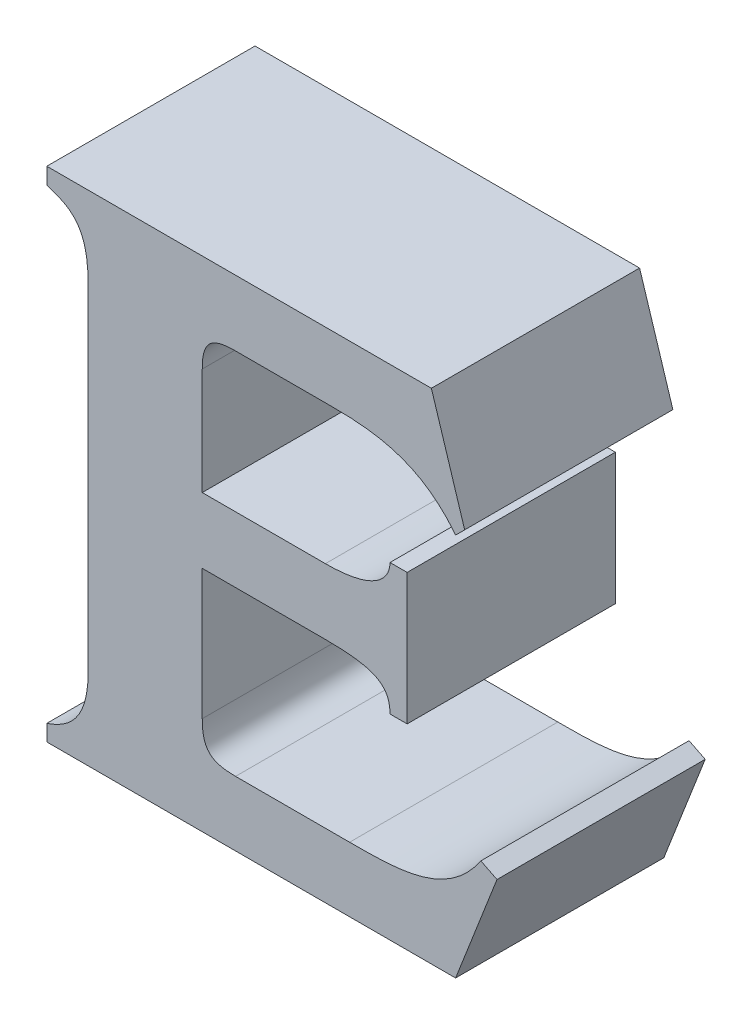
ISO-10303-21;
HEADER;
FILE_DESCRIPTION(('STEP AP214'),'2;1');
FILE_NAME('part.step','',(''),(''),'','','');
FILE_SCHEMA(('AUTOMOTIVE_DESIGN { 1 0 10303 214 1 1 1 1 }'));
ENDSEC;
DATA;
#1=APPLICATION_CONTEXT('core data for automotive mechanical design processes');
#2=APPLICATION_PROTOCOL_DEFINITION('international standard','automotive_design',2000,#1);
#3=PRODUCT_CONTEXT('',#1,'mechanical');
#4=PRODUCT('Part','Part','',(#3));
#5=PRODUCT_RELATED_PRODUCT_CATEGORY('part','',(#4));
#6=PRODUCT_DEFINITION_FORMATION('','',#4);
#7=PRODUCT_DEFINITION_CONTEXT('part definition',#1,'design');
#8=PRODUCT_DEFINITION('design','',#6,#7);
#9=PRODUCT_DEFINITION_SHAPE('','',#8);
#10=(LENGTH_UNIT() NAMED_UNIT(*) SI_UNIT(.MILLI.,.METRE.));
#11=(NAMED_UNIT(*) PLANE_ANGLE_UNIT() SI_UNIT($,.RADIAN.));
#12=(NAMED_UNIT(*) SI_UNIT($,.STERADIAN.) SOLID_ANGLE_UNIT());
#13=UNCERTAINTY_MEASURE_WITH_UNIT(LENGTH_MEASURE(1.E-05),#10,'distance_accuracy_value','');
#14=(GEOMETRIC_REPRESENTATION_CONTEXT(3) GLOBAL_UNCERTAINTY_ASSIGNED_CONTEXT((#13)) GLOBAL_UNIT_ASSIGNED_CONTEXT((#10,
#11,#12)) REPRESENTATION_CONTEXT('',''));
#15=CARTESIAN_POINT('',(0.,0.,0.));
#16=DIRECTION('',(0.,0.,1.));
#17=DIRECTION('',(1.,0.,0.));
#18=AXIS2_PLACEMENT_3D('',#15,#16,#17);
#19=CARTESIAN_POINT('',(3.83157900996,-0.200329401425036,0.));
#20=CARTESIAN_POINT('',(3.83157900996,-0.200329401425036,0.1));
#21=CARTESIAN_POINT('',(3.8432141238243,-0.20420750912214,0.));
#22=CARTESIAN_POINT('',(3.8432141238243,-0.20420750912214,0.1));
#23=CARTESIAN_POINT('',(3.8514555885926,-0.2080857603454,0.));
#24=CARTESIAN_POINT('',(3.8514555885926,-0.2080857603454,0.1));
#25=CARTESIAN_POINT('',(3.8514555894469,-0.231839582517053,0.));
#26=CARTESIAN_POINT('',(3.8514555894469,-0.231839582517053,0.1));
#27=B_SPLINE_SURFACE_WITH_KNOTS('',3,1,((#19,#20),(#21,#22),(#23,#24),(#25,#26)),.UNSPECIFIED.,
.F.,.F.,.F.,(4,4),(2,2),(-1.,0.),(0.,0.01),.UNSPECIFIED.);
#28=CARTESIAN_POINT('',(3.8514555894469,-0.231839582517053,0.));
#29=CARTESIAN_POINT('',(3.8514555885926,-0.2080857603454,0.));
#30=CARTESIAN_POINT('',(3.8432141238243,-0.20420750912214,0.));
#31=CARTESIAN_POINT('',(3.83157900996,-0.200329401425036,0.));
#32=B_SPLINE_CURVE_WITH_KNOTS('',3,(#28,#29,#30,#31),.UNSPECIFIED.,.F.,.F.,(4,4),(0.,1.),.UNSPECIFIED.);
#33=CARTESIAN_POINT('',(3.8514555894469,-0.231839582517053,0.));
#34=VERTEX_POINT('',#33);
#35=CARTESIAN_POINT('',(3.83157900996,-0.200329401425036,0.));
#36=VERTEX_POINT('',#35);
#37=EDGE_CURVE('E11',#34,#36,#32,.T.);
#38=DIRECTION('',(0.,0.,1.));
#39=VECTOR('',#38,1.);
#40=CARTESIAN_POINT('',(3.8514555894469,-0.231839582517053,0.));
#41=LINE('',#40,#39);
#42=CARTESIAN_POINT('',(3.8514555894469,-0.231839582517053,0.1));
#43=VERTEX_POINT('',#42);
#44=EDGE_CURVE('E28',#34,#43,#41,.T.);
#45=CARTESIAN_POINT('',(3.83157900996,-0.200329401425036,0.1));
#46=CARTESIAN_POINT('',(3.8432141238243,-0.20420750912214,0.1));
#47=CARTESIAN_POINT('',(3.8514555885926,-0.2080857603454,0.1));
#48=CARTESIAN_POINT('',(3.8514555894469,-0.231839582517053,0.1));
#49=B_SPLINE_CURVE_WITH_KNOTS('',3,(#45,#46,#47,#48),.UNSPECIFIED.,.F.,.F.,(4,4),(-1.,0.),.UNSPECIFIED.);
#50=CARTESIAN_POINT('',(3.83157900996,-0.200329401425036,0.1));
#51=VERTEX_POINT('',#50);
#52=EDGE_CURVE('E212',#51,#43,#49,.T.);
#53=DIRECTION('',(0.,0.,1.));
#54=VECTOR('',#53,1.);
#55=CARTESIAN_POINT('',(3.83157900996,-0.200329401425036,0.));
#56=LINE('',#55,#54);
#57=EDGE_CURVE('E467',#36,#51,#56,.T.);
#58=ORIENTED_EDGE('',*,*,#37,.F.);
#59=ORIENTED_EDGE('',*,*,#44,.T.);
#60=ORIENTED_EDGE('',*,*,#52,.F.);
#61=ORIENTED_EDGE('',*,*,#57,.F.);
#62=EDGE_LOOP('',(#58,#59,#60,#61));
#63=FACE_BOUND('',#62,.T.);
#64=ADVANCED_FACE('F17',(#63),#27,.T.);
#65=CARTESIAN_POINT('',(3.83157900996,-0.19257300647474,0.));
#66=DIRECTION('',(-1.,0.,0.));
#67=DIRECTION('',(0.,-1.,0.));
#68=AXIS2_PLACEMENT_3D('',#65,#66,#67);
#69=PLANE('',#68);
#70=DIRECTION('',(0.,1.,0.));
#71=VECTOR('',#70,1.);
#72=CARTESIAN_POINT('',(3.83157900996,-0.200329401425036,0.));
#73=LINE('',#72,#71);
#74=CARTESIAN_POINT('',(3.83157900996,-0.19257300647474,0.));
#75=VERTEX_POINT('',#74);
#76=EDGE_CURVE('E465',#36,#75,#73,.T.);
#77=ORIENTED_EDGE('',*,*,#76,.F.);
#78=ORIENTED_EDGE('',*,*,#57,.T.);
#79=DIRECTION('',(0.,-1.,0.));
#80=VECTOR('',#79,1.);
#81=CARTESIAN_POINT('',(3.83157900996,-0.200329401425036,0.1));
#82=LINE('',#81,#80);
#83=CARTESIAN_POINT('',(3.83157900996,-0.19257300647474,0.1));
#84=VERTEX_POINT('',#83);
#85=EDGE_CURVE('E463',#84,#51,#82,.T.);
#86=ORIENTED_EDGE('',*,*,#85,.F.);
#87=DIRECTION('',(0.,0.,1.));
#88=VECTOR('',#87,1.);
#89=CARTESIAN_POINT('',(3.83157900996,-0.19257300647474,0.));
#90=LINE('',#89,#88);
#91=EDGE_CURVE('E460',#75,#84,#90,.T.);
#92=ORIENTED_EDGE('',*,*,#91,.F.);
#93=EDGE_LOOP('',(#77,#78,#86,#92));
#94=FACE_BOUND('',#93,.T.);
#95=ADVANCED_FACE('F566',(#94),#69,.T.);
#96=CARTESIAN_POINT('',(4.0162776760592,-0.19257300647474,0.));
#97=DIRECTION('',(0.,1.,0.));
#98=DIRECTION('',(-1.,0.,0.));
#99=AXIS2_PLACEMENT_3D('',#96,#97,#98);
#100=PLANE('',#99);
#101=DIRECTION('',(1.,0.,0.));
#102=VECTOR('',#101,1.);
#103=CARTESIAN_POINT('',(3.83157900996,-0.19257300647474,0.));
#104=LINE('',#103,#102);
#105=CARTESIAN_POINT('',(4.0162776760592,-0.19257300647474,0.));
#106=VERTEX_POINT('',#105);
#107=EDGE_CURVE('E458',#75,#106,#104,.T.);
#108=ORIENTED_EDGE('',*,*,#107,.F.);
#109=ORIENTED_EDGE('',*,*,#91,.T.);
#110=DIRECTION('',(-1.,0.,0.));
#111=VECTOR('',#110,1.);
#112=CARTESIAN_POINT('',(3.83157900996,-0.19257300647474,0.1));
#113=LINE('',#112,#111);
#114=CARTESIAN_POINT('',(4.0162776760592,-0.19257300647474,0.1));
#115=VERTEX_POINT('',#114);
#116=EDGE_CURVE('E455',#115,#84,#113,.T.);
#117=ORIENTED_EDGE('',*,*,#116,.F.);
#118=DIRECTION('',(0.,0.,1.));
#119=VECTOR('',#118,1.);
#120=CARTESIAN_POINT('',(4.0162776760592,-0.19257300647474,0.));
#121=LINE('',#120,#119);
#122=EDGE_CURVE('E452',#106,#115,#121,.T.);
#123=ORIENTED_EDGE('',*,*,#122,.F.);
#124=EDGE_LOOP('',(#108,#109,#117,#123));
#125=FACE_BOUND('',#124,.T.);
#126=ADVANCED_FACE('F562',(#125),#100,.T.);
#127=CARTESIAN_POINT('',(4.0322752834296,-0.243474084867917,0.));
#128=DIRECTION('',(0.953993043631205,0.299828738954874,0.));
#129=DIRECTION('',(-0.299828738954874,0.953993043631205,0.));
#130=AXIS2_PLACEMENT_3D('',#127,#128,#129);
#131=PLANE('',#130);
#132=DIRECTION('',(0.299828738954873,-0.953993043631205,0.));
#133=VECTOR('',#132,1.);
#134=CARTESIAN_POINT('',(4.0162776760592,-0.19257300647474,0.));
#135=LINE('',#134,#133);
#136=CARTESIAN_POINT('',(4.0322752834296,-0.243474084867917,0.));
#137=VERTEX_POINT('',#136);
#138=EDGE_CURVE('E450',#106,#137,#135,.T.);
#139=ORIENTED_EDGE('',*,*,#138,.F.);
#140=ORIENTED_EDGE('',*,*,#122,.T.);
#141=DIRECTION('',(-0.299828738954873,0.953993043631205,0.));
#142=VECTOR('',#141,1.);
#143=CARTESIAN_POINT('',(4.0162776760592,-0.19257300647474,0.1));
#144=LINE('',#143,#142);
#145=CARTESIAN_POINT('',(4.0322752834296,-0.243474084867917,0.1));
#146=VERTEX_POINT('',#145);
#147=EDGE_CURVE('E447',#146,#115,#144,.T.);
#148=ORIENTED_EDGE('',*,*,#147,.F.);
#149=DIRECTION('',(0.,0.,1.));
#150=VECTOR('',#149,1.);
#151=CARTESIAN_POINT('',(4.0322752834296,-0.243474084867917,0.));
#152=LINE('',#151,#150);
#153=EDGE_CURVE('E444',#137,#146,#152,.T.);
#154=ORIENTED_EDGE('',*,*,#153,.F.);
#155=EDGE_LOOP('',(#139,#140,#148,#154));
#156=FACE_BOUND('',#155,.T.);
#157=ADVANCED_FACE('F558',(#156),#131,.T.);
#158=CARTESIAN_POINT('',(4.0279127909175,-0.247837117827599,0.));
#159=DIRECTION('',(0.707150577097305,-0.707062982563045,0.));
#160=DIRECTION('',(0.707062982563045,0.707150577097305,0.));
#161=AXIS2_PLACEMENT_3D('',#158,#159,#160);
#162=PLANE('',#161);
#163=DIRECTION('',(-0.707062982563045,-0.707150577097305,0.));
#164=VECTOR('',#163,1.);
#165=CARTESIAN_POINT('',(4.0322752834296,-0.243474084867917,0.));
#166=LINE('',#165,#164);
#167=CARTESIAN_POINT('',(4.0279127909175,-0.247837117827599,0.));
#168=VERTEX_POINT('',#167);
#169=EDGE_CURVE('E442',#137,#168,#166,.T.);
#170=ORIENTED_EDGE('',*,*,#169,.F.);
#171=ORIENTED_EDGE('',*,*,#153,.T.);
#172=DIRECTION('',(0.707062982563045,0.707150577097305,0.));
#173=VECTOR('',#172,1.);
#174=CARTESIAN_POINT('',(4.0322752834296,-0.243474084867917,0.1));
#175=LINE('',#174,#173);
#176=CARTESIAN_POINT('',(4.0279127909175,-0.247837117827599,0.1));
#177=VERTEX_POINT('',#176);
#178=EDGE_CURVE('E439',#177,#146,#175,.T.);
#179=ORIENTED_EDGE('',*,*,#178,.F.);
#180=DIRECTION('',(0.,0.,1.));
#181=VECTOR('',#180,1.);
#182=CARTESIAN_POINT('',(4.0279127909175,-0.247837117827599,0.));
#183=LINE('',#182,#181);
#184=EDGE_CURVE('E433',#168,#177,#183,.T.);
#185=ORIENTED_EDGE('',*,*,#184,.F.);
#186=EDGE_LOOP('',(#170,#171,#179,#185));
#187=FACE_BOUND('',#186,.T.);
#188=ADVANCED_FACE('F554',(#187),#162,.T.);
#189=CARTESIAN_POINT('',(3.9692551374246,-0.224083187566746,0.));
#190=CARTESIAN_POINT('',(3.9692551374246,-0.224083187566746,0.1));
#191=CARTESIAN_POINT('',(3.9925235660036,-0.224083187039413,0.));
#192=CARTESIAN_POINT('',(3.9925235660036,-0.224083187039413,0.1));
#193=CARTESIAN_POINT('',(4.0124001454327,-0.227961438855419,0.));
#194=CARTESIAN_POINT('',(4.0124001454327,-0.227961438855419,0.1));
#195=CARTESIAN_POINT('',(4.0279127909175,-0.247837117827599,0.));
#196=CARTESIAN_POINT('',(4.0279127909175,-0.247837117827599,0.1));
#197=B_SPLINE_SURFACE_WITH_KNOTS('',3,1,((#189,#190),(#191,#192),(#193,#194),(#195,#196)),
.UNSPECIFIED.,.F.,.F.,.F.,(4,4),(2,2),(-1.,0.),(0.,0.01),.UNSPECIFIED.);
#198=CARTESIAN_POINT('',(4.0279127909175,-0.247837117827599,0.));
#199=CARTESIAN_POINT('',(4.0124001454327,-0.227961438855419,0.));
#200=CARTESIAN_POINT('',(3.9925235660036,-0.224083187039413,0.));
#201=CARTESIAN_POINT('',(3.9692551374246,-0.224083187566746,0.));
#202=B_SPLINE_CURVE_WITH_KNOTS('',3,(#198,#199,#200,#201),.UNSPECIFIED.,.F.,.F.,(4,4),(0.,1.),.UNSPECIFIED.);
#203=CARTESIAN_POINT('',(3.9692551374246,-0.224083187566746,0.));
#204=VERTEX_POINT('',#203);
#205=EDGE_CURVE('E426',#168,#204,#202,.T.);
#206=CARTESIAN_POINT('',(3.9692551374246,-0.224083187566746,0.1));
#207=CARTESIAN_POINT('',(3.9925235660036,-0.224083187039413,0.1));
#208=CARTESIAN_POINT('',(4.0124001454327,-0.227961438855419,0.1));
#209=CARTESIAN_POINT('',(4.0279127909175,-0.247837117827599,0.1));
#210=B_SPLINE_CURVE_WITH_KNOTS('',3,(#206,#207,#208,#209),.UNSPECIFIED.,.F.,.F.,(4,4),(-1.,0.),.UNSPECIFIED.);
#211=CARTESIAN_POINT('',(3.9692551374246,-0.224083187566746,0.1));
#212=VERTEX_POINT('',#211);
#213=EDGE_CURVE('E421',#212,#177,#210,.T.);
#214=DIRECTION('',(0.,0.,1.));
#215=VECTOR('',#214,1.);
#216=CARTESIAN_POINT('',(3.9692551374246,-0.224083187566746,0.));
#217=LINE('',#216,#215);
#218=EDGE_CURVE('E418',#204,#212,#217,.T.);
#219=ORIENTED_EDGE('',*,*,#205,.F.);
#220=ORIENTED_EDGE('',*,*,#184,.T.);
#221=ORIENTED_EDGE('',*,*,#213,.F.);
#222=ORIENTED_EDGE('',*,*,#218,.F.);
#223=EDGE_LOOP('',(#219,#220,#221,#222));
#224=FACE_BOUND('',#223,.T.);
#225=ADVANCED_FACE('F550',(#224),#197,.T.);
#226=CARTESIAN_POINT('',(3.9222322384924,-0.224083187566746,0.));
#227=DIRECTION('',(0.,-1.,0.));
#228=DIRECTION('',(1.,0.,0.));
#229=AXIS2_PLACEMENT_3D('',#226,#227,#228);
#230=PLANE('',#229);
#231=DIRECTION('',(-1.,0.,0.));
#232=VECTOR('',#231,1.);
#233=CARTESIAN_POINT('',(3.9692551374246,-0.224083187566746,0.));
#234=LINE('',#233,#232);
#235=CARTESIAN_POINT('',(3.9222322384924,-0.224083187566746,0.));
#236=VERTEX_POINT('',#235);
#237=EDGE_CURVE('E416',#204,#236,#234,.T.);
#238=ORIENTED_EDGE('',*,*,#237,.F.);
#239=ORIENTED_EDGE('',*,*,#218,.T.);
#240=DIRECTION('',(1.,0.,0.));
#241=VECTOR('',#240,1.);
#242=CARTESIAN_POINT('',(3.9692551374246,-0.224083187566746,0.1));
#243=LINE('',#242,#241);
#244=CARTESIAN_POINT('',(3.9222322384924,-0.224083187566746,0.1));
#245=VERTEX_POINT('',#244);
#246=EDGE_CURVE('E413',#245,#212,#243,.T.);
#247=ORIENTED_EDGE('',*,*,#246,.F.);
#248=DIRECTION('',(0.,0.,1.));
#249=VECTOR('',#248,1.);
#250=CARTESIAN_POINT('',(3.9222322384924,-0.224083187566746,0.));
#251=LINE('',#250,#249);
#252=EDGE_CURVE('E407',#236,#245,#251,.T.);
#253=ORIENTED_EDGE('',*,*,#252,.F.);
#254=EDGE_LOOP('',(#238,#239,#247,#253));
#255=FACE_BOUND('',#254,.T.);
#256=ADVANCED_FACE('F546',(#255),#230,.T.);
#257=CARTESIAN_POINT('',(3.906234631122,-0.23959597746735,0.));
#258=CARTESIAN_POINT('',(3.906234631122,-0.23959597746735,0.1));
#259=CARTESIAN_POINT('',(3.9062346311798,-0.227961439325073,0.));
#260=CARTESIAN_POINT('',(3.9062346311798,-0.227961439325073,0.1));
#261=CARTESIAN_POINT('',(3.9101136032387,-0.224083187747447,0.));
#262=CARTESIAN_POINT('',(3.9101136032387,-0.224083187747447,0.1));
#263=CARTESIAN_POINT('',(3.9222322384924,-0.224083187566746,0.));
#264=CARTESIAN_POINT('',(3.9222322384924,-0.224083187566746,0.1));
#265=B_SPLINE_SURFACE_WITH_KNOTS('',3,1,((#257,#258),(#259,#260),(#261,#262),(#263,#264)),
.UNSPECIFIED.,.F.,.F.,.F.,(4,4),(2,2),(-1.,0.),(0.,0.01),.UNSPECIFIED.);
#266=CARTESIAN_POINT('',(3.9222322384924,-0.224083187566746,0.));
#267=CARTESIAN_POINT('',(3.9101136032387,-0.224083187747447,0.));
#268=CARTESIAN_POINT('',(3.9062346311798,-0.227961439325073,0.));
#269=CARTESIAN_POINT('',(3.906234631122,-0.23959597746735,0.));
#270=B_SPLINE_CURVE_WITH_KNOTS('',3,(#266,#267,#268,#269),.UNSPECIFIED.,.F.,.F.,(4,4),(0.,1.),.UNSPECIFIED.);
#271=CARTESIAN_POINT('',(3.906234631122,-0.23959597746735,0.));
#272=VERTEX_POINT('',#271);
#273=EDGE_CURVE('E400',#236,#272,#270,.T.);
#274=CARTESIAN_POINT('',(3.906234631122,-0.23959597746735,0.1));
#275=CARTESIAN_POINT('',(3.9062346311798,-0.227961439325073,0.1));
#276=CARTESIAN_POINT('',(3.9101136032387,-0.224083187747447,0.1));
#277=CARTESIAN_POINT('',(3.9222322384924,-0.224083187566746,0.1));
#278=B_SPLINE_CURVE_WITH_KNOTS('',3,(#274,#275,#276,#277),.UNSPECIFIED.,.F.,.F.,(4,4),(-1.,0.),.UNSPECIFIED.);
#279=CARTESIAN_POINT('',(3.906234631122,-0.23959597746735,0.1));
#280=VERTEX_POINT('',#279);
#281=EDGE_CURVE('E395',#280,#245,#278,.T.);
#282=DIRECTION('',(0.,0.,1.));
#283=VECTOR('',#282,1.);
#284=CARTESIAN_POINT('',(3.906234631122,-0.23959597746735,0.));
#285=LINE('',#284,#283);
#286=EDGE_CURVE('E392',#272,#280,#285,.T.);
#287=ORIENTED_EDGE('',*,*,#273,.F.);
#288=ORIENTED_EDGE('',*,*,#252,.T.);
#289=ORIENTED_EDGE('',*,*,#281,.F.);
#290=ORIENTED_EDGE('',*,*,#286,.F.);
#291=EDGE_LOOP('',(#287,#288,#289,#290));
#292=FACE_BOUND('',#291,.T.);
#293=ADVANCED_FACE('F542',(#292),#265,.T.);
#294=CARTESIAN_POINT('',(3.906234631122,-0.290981837300069,0.));
#295=DIRECTION('',(1.,0.,0.));
#296=DIRECTION('',(0.,1.,0.));
#297=AXIS2_PLACEMENT_3D('',#294,#295,#296);
#298=PLANE('',#297);
#299=DIRECTION('',(0.,-1.,0.));
#300=VECTOR('',#299,1.);
#301=CARTESIAN_POINT('',(3.906234631122,-0.23959597746735,0.));
#302=LINE('',#301,#300);
#303=CARTESIAN_POINT('',(3.906234631122,-0.290981837300069,0.));
#304=VERTEX_POINT('',#303);
#305=EDGE_CURVE('E390',#272,#304,#302,.T.);
#306=ORIENTED_EDGE('',*,*,#305,.F.);
#307=ORIENTED_EDGE('',*,*,#286,.T.);
#308=DIRECTION('',(0.,1.,0.));
#309=VECTOR('',#308,1.);
#310=CARTESIAN_POINT('',(3.906234631122,-0.23959597746735,0.1));
#311=LINE('',#310,#309);
#312=CARTESIAN_POINT('',(3.906234631122,-0.290981837300069,0.1));
#313=VERTEX_POINT('',#312);
#314=EDGE_CURVE('E387',#313,#280,#311,.T.);
#315=ORIENTED_EDGE('',*,*,#314,.F.);
#316=DIRECTION('',(0.,0.,1.));
#317=VECTOR('',#316,1.);
#318=CARTESIAN_POINT('',(3.906234631122,-0.290981837300069,0.));
#319=LINE('',#318,#317);
#320=EDGE_CURVE('E384',#304,#313,#319,.T.);
#321=ORIENTED_EDGE('',*,*,#320,.F.);
#322=EDGE_LOOP('',(#306,#307,#315,#321));
#323=FACE_BOUND('',#322,.T.);
#324=ADVANCED_FACE('F538',(#323),#298,.T.);
#325=CARTESIAN_POINT('',(3.9653776065019,-0.290981837300069,0.));
#326=DIRECTION('',(0.,1.,0.));
#327=DIRECTION('',(-1.,0.,0.));
#328=AXIS2_PLACEMENT_3D('',#325,#326,#327);
#329=PLANE('',#328);
#330=DIRECTION('',(1.,0.,0.));
#331=VECTOR('',#330,1.);
#332=CARTESIAN_POINT('',(3.906234631122,-0.290981837300069,0.));
#333=LINE('',#332,#331);
#334=CARTESIAN_POINT('',(3.9653776065019,-0.290981837300069,0.));
#335=VERTEX_POINT('',#334);
#336=EDGE_CURVE('E382',#304,#335,#333,.T.);
#337=ORIENTED_EDGE('',*,*,#336,.F.);
#338=ORIENTED_EDGE('',*,*,#320,.T.);
#339=DIRECTION('',(-1.,0.,0.));
#340=VECTOR('',#339,1.);
#341=CARTESIAN_POINT('',(3.906234631122,-0.290981837300069,0.1));
#342=LINE('',#341,#340);
#343=CARTESIAN_POINT('',(3.9653776065019,-0.290981837300069,0.1));
#344=VERTEX_POINT('',#343);
#345=EDGE_CURVE('E379',#344,#313,#342,.T.);
#346=ORIENTED_EDGE('',*,*,#345,.F.);
#347=DIRECTION('',(0.,0.,1.));
#348=VECTOR('',#347,1.);
#349=CARTESIAN_POINT('',(3.9653776065019,-0.290981837300069,0.));
#350=LINE('',#349,#348);
#351=EDGE_CURVE('E373',#335,#344,#350,.T.);
#352=ORIENTED_EDGE('',*,*,#351,.F.);
#353=EDGE_LOOP('',(#337,#338,#346,#352));
#354=FACE_BOUND('',#353,.T.);
#355=ADVANCED_FACE('F534',(#354),#329,.T.);
#356=CARTESIAN_POINT('',(3.9964025377662,-0.274984410079678,0.));
#357=CARTESIAN_POINT('',(3.9964025377662,-0.274984410079678,0.1));
#358=CARTESIAN_POINT('',(3.9964025376758,-0.276316552209228,0.));
#359=CARTESIAN_POINT('',(3.9964025376758,-0.276316552209228,0.1));
#360=CARTESIAN_POINT('',(3.996173744356,-0.277625134831943,0.));
#361=CARTESIAN_POINT('',(3.996173744356,-0.277625134831943,0.1));
#362=CARTESIAN_POINT('',(3.9952123586862,-0.280248642042615,0.));
#363=CARTESIAN_POINT('',(3.9952123586862,-0.280248642042615,0.1));
#364=CARTESIAN_POINT('',(3.9944564283637,-0.28149279445267,0.));
#365=CARTESIAN_POINT('',(3.9944564283637,-0.28149279445267,0.1));
#366=CARTESIAN_POINT('',(3.9920118436942,-0.284359094498315,0.));
#367=CARTESIAN_POINT('',(3.9920118436942,-0.284359094498315,0.1));
#368=CARTESIAN_POINT('',(3.9900916713089,-0.285726324559704,0.));
#369=CARTESIAN_POINT('',(3.9900916713089,-0.285726324559704,0.1));
#370=CARTESIAN_POINT('',(3.98518525554,-0.288264708127073,0.));
#371=CARTESIAN_POINT('',(3.98518525554,-0.288264708127073,0.1));
#372=CARTESIAN_POINT('',(3.9819491899533,-0.28921785406085,0.));
#373=CARTESIAN_POINT('',(3.9819491899533,-0.28921785406085,0.1));
#374=CARTESIAN_POINT('',(3.9744455935896,-0.290683127188443,0.));
#375=CARTESIAN_POINT('',(3.9744455935896,-0.290683127188443,0.1));
#376=CARTESIAN_POINT('',(3.9698076102043,-0.290981837272819,0.));
#377=CARTESIAN_POINT('',(3.9698076102043,-0.290981837272819,0.1));
#378=CARTESIAN_POINT('',(3.9653776065019,-0.290981837300069,0.));
#379=CARTESIAN_POINT('',(3.9653776065019,-0.290981837300069,0.1));
#380=B_SPLINE_SURFACE_WITH_KNOTS('',3,1,((#356,#357),(#358,#359),(#360,#361),(#362,#363),(#364,
#365),(#366,#367),(#368,#369),(#370,#371),(#372,#373),(#374,#375),(#376,#377),(#378,#379)),
.UNSPECIFIED.,.F.,.F.,.F.,(4,2,2,2,2,4),(2,2),(-0.0033200045290419,-0.0029712285973443,
-0.0025891120870216,-0.0019873264908764,-0.0011506503123292,0.),(0.,0.01),.UNSPECIFIED.);
#381=CARTESIAN_POINT('',(3.9653776065019,-0.290981837300069,0.));
#382=CARTESIAN_POINT('',(3.9698076102043,-0.290981837272819,0.));
#383=CARTESIAN_POINT('',(3.9744455935896,-0.290683127188443,0.));
#384=CARTESIAN_POINT('',(3.9819491899533,-0.28921785406085,0.));
#385=CARTESIAN_POINT('',(3.98518525554,-0.288264708127073,0.));
#386=CARTESIAN_POINT('',(3.9900916713089,-0.285726324559704,0.));
#387=CARTESIAN_POINT('',(3.9920118436942,-0.284359094498315,0.));
#388=CARTESIAN_POINT('',(3.9944564283637,-0.28149279445267,0.));
#389=CARTESIAN_POINT('',(3.9952123586862,-0.280248642042615,0.));
#390=CARTESIAN_POINT('',(3.996173744356,-0.277625134831943,0.));
#391=CARTESIAN_POINT('',(3.9964025376758,-0.276316552209228,0.));
#392=CARTESIAN_POINT('',(3.9964025377662,-0.274984410079678,0.));
#393=B_SPLINE_CURVE_WITH_KNOTS('',3,(#381,#382,#383,#384,#385,#386,#387,#388,#389,#390,#391,
#392),.UNSPECIFIED.,.F.,.F.,(4,2,2,2,2,4),(0.,0.0011506503123292,0.0019873264908764,
0.0025891120870216,0.0029712285973443,0.0033200045290419),.UNSPECIFIED.);
#394=CARTESIAN_POINT('',(3.9964025377662,-0.274984410079678,0.));
#395=VERTEX_POINT('',#394);
#396=EDGE_CURVE('E366',#335,#395,#393,.T.);
#397=CARTESIAN_POINT('',(3.9964025377662,-0.274984410079678,0.1));
#398=CARTESIAN_POINT('',(3.9964025376758,-0.276316552209228,0.1));
#399=CARTESIAN_POINT('',(3.996173744356,-0.277625134831943,0.1));
#400=CARTESIAN_POINT('',(3.9952123586862,-0.280248642042615,0.1));
#401=CARTESIAN_POINT('',(3.9944564283637,-0.28149279445267,0.1));
#402=CARTESIAN_POINT('',(3.9920118436942,-0.284359094498315,0.1));
#403=CARTESIAN_POINT('',(3.9900916713089,-0.285726324559704,0.1));
#404=CARTESIAN_POINT('',(3.98518525554,-0.288264708127073,0.1));
#405=CARTESIAN_POINT('',(3.9819491899533,-0.28921785406085,0.1));
#406=CARTESIAN_POINT('',(3.9744455935896,-0.290683127188443,0.1));
#407=CARTESIAN_POINT('',(3.9698076102043,-0.290981837272819,0.1));
#408=CARTESIAN_POINT('',(3.9653776065019,-0.290981837300069,0.1));
#409=B_SPLINE_CURVE_WITH_KNOTS('',3,(#397,#398,#399,#400,#401,#402,#403,#404,#405,#406,#407,
#408),.UNSPECIFIED.,.F.,.F.,(4,2,2,2,2,4),(-0.0033200045290419,-0.0029712285973443,
-0.0025891120870216,-0.0019873264908764,-0.0011506503123292,0.),.UNSPECIFIED.);
#410=CARTESIAN_POINT('',(3.9964025377662,-0.274984410079678,0.1));
#411=VERTEX_POINT('',#410);
#412=EDGE_CURVE('E361',#411,#344,#409,.T.);
#413=DIRECTION('',(0.,0.,1.));
#414=VECTOR('',#413,1.);
#415=CARTESIAN_POINT('',(3.9964025377662,-0.274984410079678,0.));
#416=LINE('',#415,#414);
#417=EDGE_CURVE('E358',#395,#411,#416,.T.);
#418=ORIENTED_EDGE('',*,*,#396,.F.);
#419=ORIENTED_EDGE('',*,*,#351,.T.);
#420=ORIENTED_EDGE('',*,*,#412,.F.);
#421=ORIENTED_EDGE('',*,*,#417,.F.);
#422=EDGE_LOOP('',(#418,#419,#420,#421));
#423=FACE_BOUND('',#422,.T.);
#424=ADVANCED_FACE('F530',(#423),#380,.T.);
#425=CARTESIAN_POINT('',(4.0046440023949,-0.274984410079678,0.));
#426=DIRECTION('',(0.,1.,0.));
#427=DIRECTION('',(-1.,0.,0.));
#428=AXIS2_PLACEMENT_3D('',#425,#426,#427);
#429=PLANE('',#428);
#430=DIRECTION('',(1.,0.,0.));
#431=VECTOR('',#430,1.);
#432=CARTESIAN_POINT('',(3.9964025377662,-0.274984410079678,0.));
#433=LINE('',#432,#431);
#434=CARTESIAN_POINT('',(4.0046440023949,-0.274984410079678,0.));
#435=VERTEX_POINT('',#434);
#436=EDGE_CURVE('E356',#395,#435,#433,.T.);
#437=ORIENTED_EDGE('',*,*,#436,.F.);
#438=ORIENTED_EDGE('',*,*,#417,.T.);
#439=DIRECTION('',(-1.,0.,0.));
#440=VECTOR('',#439,1.);
#441=CARTESIAN_POINT('',(3.9964025377662,-0.274984410079678,0.1));
#442=LINE('',#441,#440);
#443=CARTESIAN_POINT('',(4.0046440023949,-0.274984410079678,0.1));
#444=VERTEX_POINT('',#443);
#445=EDGE_CURVE('E353',#444,#411,#442,.T.);
#446=ORIENTED_EDGE('',*,*,#445,.F.);
#447=DIRECTION('',(0.,0.,1.));
#448=VECTOR('',#447,1.);
#449=CARTESIAN_POINT('',(4.0046440023949,-0.274984410079678,0.));
#450=LINE('',#449,#448);
#451=EDGE_CURVE('E350',#435,#444,#450,.T.);
#452=ORIENTED_EDGE('',*,*,#451,.F.);
#453=EDGE_LOOP('',(#437,#438,#446,#452));
#454=FACE_BOUND('',#453,.T.);
#455=ADVANCED_FACE('F526',(#454),#429,.T.);
#456=CARTESIAN_POINT('',(4.0046440023949,-0.338004772263689,0.));
#457=DIRECTION('',(1.,0.,0.));
#458=DIRECTION('',(0.,1.,0.));
#459=AXIS2_PLACEMENT_3D('',#456,#457,#458);
#460=PLANE('',#459);
#461=DIRECTION('',(0.,-1.,0.));
#462=VECTOR('',#461,1.);
#463=CARTESIAN_POINT('',(4.0046440023949,-0.274984410079678,0.));
#464=LINE('',#463,#462);
#465=CARTESIAN_POINT('',(4.0046440023949,-0.338004772263689,0.));
#466=VERTEX_POINT('',#465);
#467=EDGE_CURVE('E348',#435,#466,#464,.T.);
#468=ORIENTED_EDGE('',*,*,#467,.F.);
#469=ORIENTED_EDGE('',*,*,#451,.T.);
#470=DIRECTION('',(0.,1.,0.));
#471=VECTOR('',#470,1.);
#472=CARTESIAN_POINT('',(4.0046440023949,-0.274984410079678,0.1));
#473=LINE('',#472,#471);
#474=CARTESIAN_POINT('',(4.0046440023949,-0.338004772263689,0.1));
#475=VERTEX_POINT('',#474);
#476=EDGE_CURVE('E345',#475,#444,#473,.T.);
#477=ORIENTED_EDGE('',*,*,#476,.F.);
#478=DIRECTION('',(0.,0.,1.));
#479=VECTOR('',#478,1.);
#480=CARTESIAN_POINT('',(4.0046440023949,-0.338004772263689,0.));
#481=LINE('',#480,#479);
#482=EDGE_CURVE('E342',#466,#475,#481,.T.);
#483=ORIENTED_EDGE('',*,*,#482,.F.);
#484=EDGE_LOOP('',(#468,#469,#477,#483));
#485=FACE_BOUND('',#484,.T.);
#486=ADVANCED_FACE('F522',(#485),#460,.T.);
#487=CARTESIAN_POINT('',(3.9964025377662,-0.338004772263689,0.));
#488=DIRECTION('',(0.,-1.,0.));
#489=DIRECTION('',(1.,0.,0.));
#490=AXIS2_PLACEMENT_3D('',#487,#488,#489);
#491=PLANE('',#490);
#492=DIRECTION('',(-1.,0.,0.));
#493=VECTOR('',#492,1.);
#494=CARTESIAN_POINT('',(4.0046440023949,-0.338004772263689,0.));
#495=LINE('',#494,#493);
#496=CARTESIAN_POINT('',(3.9964025377662,-0.338004772263689,0.));
#497=VERTEX_POINT('',#496);
#498=EDGE_CURVE('E340',#466,#497,#495,.T.);
#499=ORIENTED_EDGE('',*,*,#498,.F.);
#500=ORIENTED_EDGE('',*,*,#482,.T.);
#501=DIRECTION('',(1.,0.,0.));
#502=VECTOR('',#501,1.);
#503=CARTESIAN_POINT('',(4.0046440023949,-0.338004772263689,0.1));
#504=LINE('',#503,#502);
#505=CARTESIAN_POINT('',(3.9964025377662,-0.338004772263689,0.1));
#506=VERTEX_POINT('',#505);
#507=EDGE_CURVE('E337',#506,#475,#504,.T.);
#508=ORIENTED_EDGE('',*,*,#507,.F.);
#509=DIRECTION('',(0.,0.,1.));
#510=VECTOR('',#509,1.);
#511=CARTESIAN_POINT('',(3.9964025377662,-0.338004772263689,0.));
#512=LINE('',#511,#510);
#513=EDGE_CURVE('E331',#497,#506,#512,.T.);
#514=ORIENTED_EDGE('',*,*,#513,.F.);
#515=EDGE_LOOP('',(#499,#500,#508,#514));
#516=FACE_BOUND('',#515,.T.);
#517=ADVANCED_FACE('F518',(#516),#491,.T.);
#518=CARTESIAN_POINT('',(3.9653776065019,-0.322492018392074,0.));
#519=CARTESIAN_POINT('',(3.9653776065019,-0.322492018392074,0.1));
#520=CARTESIAN_POINT('',(3.9886463950244,-0.322492018392137,0.));
#521=CARTESIAN_POINT('',(3.9886463950244,-0.322492018392137,0.1));
#522=CARTESIAN_POINT('',(3.9964025377662,-0.326370269912204,0.));
#523=CARTESIAN_POINT('',(3.9964025377662,-0.326370269912204,0.1));
#524=CARTESIAN_POINT('',(3.9964025377662,-0.338004772263689,0.));
#525=CARTESIAN_POINT('',(3.9964025377662,-0.338004772263689,0.1));
#526=B_SPLINE_SURFACE_WITH_KNOTS('',3,1,((#518,#519),(#520,#521),(#522,#523),(#524,#525)),
.UNSPECIFIED.,.F.,.F.,.F.,(4,4),(2,2),(-1.,0.),(0.,0.01),.UNSPECIFIED.);
#527=CARTESIAN_POINT('',(3.9964025377662,-0.338004772263689,0.));
#528=CARTESIAN_POINT('',(3.9964025377662,-0.326370269912204,0.));
#529=CARTESIAN_POINT('',(3.9886463950244,-0.322492018392137,0.));
#530=CARTESIAN_POINT('',(3.9653776065019,-0.322492018392074,0.));
#531=B_SPLINE_CURVE_WITH_KNOTS('',3,(#527,#528,#529,#530),.UNSPECIFIED.,.F.,.F.,(4,4),(0.,1.),.UNSPECIFIED.);
#532=CARTESIAN_POINT('',(3.9653776065019,-0.322492018392074,0.));
#533=VERTEX_POINT('',#532);
#534=EDGE_CURVE('E324',#497,#533,#531,.T.);
#535=CARTESIAN_POINT('',(3.9653776065019,-0.322492018392074,0.1));
#536=CARTESIAN_POINT('',(3.9886463950244,-0.322492018392137,0.1));
#537=CARTESIAN_POINT('',(3.9964025377662,-0.326370269912204,0.1));
#538=CARTESIAN_POINT('',(3.9964025377662,-0.338004772263689,0.1));
#539=B_SPLINE_CURVE_WITH_KNOTS('',3,(#535,#536,#537,#538),.UNSPECIFIED.,.F.,.F.,(4,4),(-1.,0.),.UNSPECIFIED.);
#540=CARTESIAN_POINT('',(3.9653776065019,-0.322492018392074,0.1));
#541=VERTEX_POINT('',#540);
#542=EDGE_CURVE('E319',#541,#506,#539,.T.);
#543=DIRECTION('',(0.,0.,1.));
#544=VECTOR('',#543,1.);
#545=CARTESIAN_POINT('',(3.9653776065019,-0.322492018392074,0.));
#546=LINE('',#545,#544);
#547=EDGE_CURVE('E316',#533,#541,#546,.T.);
#548=ORIENTED_EDGE('',*,*,#534,.F.);
#549=ORIENTED_EDGE('',*,*,#513,.T.);
#550=ORIENTED_EDGE('',*,*,#542,.F.);
#551=ORIENTED_EDGE('',*,*,#547,.F.);
#552=EDGE_LOOP('',(#548,#549,#550,#551));
#553=FACE_BOUND('',#552,.T.);
#554=ADVANCED_FACE('F514',(#553),#526,.T.);
#555=CARTESIAN_POINT('',(3.906234631122,-0.322492018392074,0.));
#556=DIRECTION('',(0.,-1.,0.));
#557=DIRECTION('',(1.,0.,0.));
#558=AXIS2_PLACEMENT_3D('',#555,#556,#557);
#559=PLANE('',#558);
#560=DIRECTION('',(-1.,0.,0.));
#561=VECTOR('',#560,1.);
#562=CARTESIAN_POINT('',(3.9653776065019,-0.322492018392074,0.));
#563=LINE('',#562,#561);
#564=CARTESIAN_POINT('',(3.906234631122,-0.322492018392074,0.));
#565=VERTEX_POINT('',#564);
#566=EDGE_CURVE('E314',#533,#565,#563,.T.);
#567=ORIENTED_EDGE('',*,*,#566,.F.);
#568=ORIENTED_EDGE('',*,*,#547,.T.);
#569=DIRECTION('',(1.,0.,0.));
#570=VECTOR('',#569,1.);
#571=CARTESIAN_POINT('',(3.9653776065019,-0.322492018392074,0.1));
#572=LINE('',#571,#570);
#573=CARTESIAN_POINT('',(3.906234631122,-0.322492018392074,0.1));
#574=VERTEX_POINT('',#573);
#575=EDGE_CURVE('E311',#574,#541,#572,.T.);
#576=ORIENTED_EDGE('',*,*,#575,.F.);
#577=DIRECTION('',(0.,0.,1.));
#578=VECTOR('',#577,1.);
#579=CARTESIAN_POINT('',(3.906234631122,-0.322492018392074,0.));
#580=LINE('',#579,#578);
#581=EDGE_CURVE('E308',#565,#574,#580,.T.);
#582=ORIENTED_EDGE('',*,*,#581,.F.);
#583=EDGE_LOOP('',(#567,#568,#576,#582));
#584=FACE_BOUND('',#583,.T.);
#585=ADVANCED_FACE('F510',(#584),#559,.T.);
#586=CARTESIAN_POINT('',(3.906234631122,-0.385027743256379,0.));
#587=DIRECTION('',(1.,0.,0.));
#588=DIRECTION('',(0.,1.,0.));
#589=AXIS2_PLACEMENT_3D('',#586,#587,#588);
#590=PLANE('',#589);
#591=DIRECTION('',(0.,-1.,0.));
#592=VECTOR('',#591,1.);
#593=CARTESIAN_POINT('',(3.906234631122,-0.322492018392074,0.));
#594=LINE('',#593,#592);
#595=CARTESIAN_POINT('',(3.906234631122,-0.385027743256379,0.));
#596=VERTEX_POINT('',#595);
#597=EDGE_CURVE('E306',#565,#596,#594,.T.);
#598=ORIENTED_EDGE('',*,*,#597,.F.);
#599=ORIENTED_EDGE('',*,*,#581,.T.);
#600=DIRECTION('',(0.,1.,0.));
#601=VECTOR('',#600,1.);
#602=CARTESIAN_POINT('',(3.906234631122,-0.322492018392074,0.1));
#603=LINE('',#602,#601);
#604=CARTESIAN_POINT('',(3.906234631122,-0.385027743256379,0.1));
#605=VERTEX_POINT('',#604);
#606=EDGE_CURVE('E303',#605,#574,#603,.T.);
#607=ORIENTED_EDGE('',*,*,#606,.F.);
#608=DIRECTION('',(0.,0.,1.));
#609=VECTOR('',#608,1.);
#610=CARTESIAN_POINT('',(3.906234631122,-0.385027743256379,0.));
#611=LINE('',#610,#609);
#612=EDGE_CURVE('E297',#596,#605,#611,.T.);
#613=ORIENTED_EDGE('',*,*,#612,.F.);
#614=EDGE_LOOP('',(#598,#599,#607,#613));
#615=FACE_BOUND('',#614,.T.);
#616=ADVANCED_FACE('F506',(#615),#590,.T.);
#617=CARTESIAN_POINT('',(3.9222322384924,-0.401025170476769,0.));
#618=CARTESIAN_POINT('',(3.9222322384924,-0.401025170476769,0.1));
#619=CARTESIAN_POINT('',(3.9101136035758,-0.401025170394981,0.));
#620=CARTESIAN_POINT('',(3.9101136035758,-0.401025170394981,0.1));
#621=CARTESIAN_POINT('',(3.9062346313775,-0.397147027047273,0.));
#622=CARTESIAN_POINT('',(3.9062346313775,-0.397147027047273,0.1));
#623=CARTESIAN_POINT('',(3.906234631122,-0.385027743256379,0.));
#624=CARTESIAN_POINT('',(3.906234631122,-0.385027743256379,0.1));
#625=B_SPLINE_SURFACE_WITH_KNOTS('',3,1,((#617,#618),(#619,#620),(#621,#622),(#623,#624)),
.UNSPECIFIED.,.F.,.F.,.F.,(4,4),(2,2),(-1.,0.),(0.,0.01),.UNSPECIFIED.);
#626=CARTESIAN_POINT('',(3.906234631122,-0.385027743256379,0.));
#627=CARTESIAN_POINT('',(3.9062346313775,-0.397147027047273,0.));
#628=CARTESIAN_POINT('',(3.9101136035758,-0.401025170394981,0.));
#629=CARTESIAN_POINT('',(3.9222322384924,-0.401025170476769,0.));
#630=B_SPLINE_CURVE_WITH_KNOTS('',3,(#626,#627,#628,#629),.UNSPECIFIED.,.F.,.F.,(4,4),(0.,1.),.UNSPECIFIED.);
#631=CARTESIAN_POINT('',(3.9222322384924,-0.401025170476769,0.));
#632=VERTEX_POINT('',#631);
#633=EDGE_CURVE('E290',#596,#632,#630,.T.);
#634=CARTESIAN_POINT('',(3.9222322384924,-0.401025170476769,0.1));
#635=CARTESIAN_POINT('',(3.9101136035758,-0.401025170394981,0.1));
#636=CARTESIAN_POINT('',(3.9062346313775,-0.397147027047273,0.1));
#637=CARTESIAN_POINT('',(3.906234631122,-0.385027743256379,0.1));
#638=B_SPLINE_CURVE_WITH_KNOTS('',3,(#634,#635,#636,#637),.UNSPECIFIED.,.F.,.F.,(4,4),(-1.,0.),.UNSPECIFIED.);
#639=CARTESIAN_POINT('',(3.9222322384924,-0.401025170476769,0.1));
#640=VERTEX_POINT('',#639);
#641=EDGE_CURVE('E285',#640,#605,#638,.T.);
#642=DIRECTION('',(0.,0.,1.));
#643=VECTOR('',#642,1.);
#644=CARTESIAN_POINT('',(3.9222322384924,-0.401025170476769,0.));
#645=LINE('',#644,#643);
#646=EDGE_CURVE('E282',#632,#640,#645,.T.);
#647=ORIENTED_EDGE('',*,*,#633,.F.);
#648=ORIENTED_EDGE('',*,*,#612,.T.);
#649=ORIENTED_EDGE('',*,*,#641,.F.);
#650=ORIENTED_EDGE('',*,*,#646,.F.);
#651=EDGE_LOOP('',(#647,#648,#649,#650));
#652=FACE_BOUND('',#651,.T.);
#653=ADVANCED_FACE('F502',(#652),#625,.T.);
#654=CARTESIAN_POINT('',(3.9770112801662,-0.401025170476769,0.));
#655=DIRECTION('',(0.,1.,0.));
#656=DIRECTION('',(-1.,0.,0.));
#657=AXIS2_PLACEMENT_3D('',#654,#655,#656);
#658=PLANE('',#657);
#659=DIRECTION('',(1.,0.,0.));
#660=VECTOR('',#659,1.);
#661=CARTESIAN_POINT('',(3.9222322384924,-0.401025170476769,0.));
#662=LINE('',#661,#660);
#663=CARTESIAN_POINT('',(3.9770112801662,-0.401025170476769,0.));
#664=VERTEX_POINT('',#663);
#665=EDGE_CURVE('E280',#632,#664,#662,.T.);
#666=ORIENTED_EDGE('',*,*,#665,.F.);
#667=ORIENTED_EDGE('',*,*,#646,.T.);
#668=DIRECTION('',(-1.,0.,0.));
#669=VECTOR('',#668,1.);
#670=CARTESIAN_POINT('',(3.9222322384924,-0.401025170476769,0.1));
#671=LINE('',#670,#669);
#672=CARTESIAN_POINT('',(3.9770112801662,-0.401025170476769,0.1));
#673=VERTEX_POINT('',#672);
#674=EDGE_CURVE('E277',#673,#640,#671,.T.);
#675=ORIENTED_EDGE('',*,*,#674,.F.);
#676=DIRECTION('',(0.,0.,1.));
#677=VECTOR('',#676,1.);
#678=CARTESIAN_POINT('',(3.9770112801662,-0.401025170476769,0.));
#679=LINE('',#678,#677);
#680=EDGE_CURVE('E271',#664,#673,#679,.T.);
#681=ORIENTED_EDGE('',*,*,#680,.F.);
#682=EDGE_LOOP('',(#666,#667,#675,#681));
#683=FACE_BOUND('',#682,.T.);
#684=ADVANCED_FACE('F498',(#683),#658,.T.);
#685=CARTESIAN_POINT('',(4.0400314261712,-0.377271348305459,0.));
#686=CARTESIAN_POINT('',(4.0400314261712,-0.377271348305459,0.1));
#687=CARTESIAN_POINT('',(4.0240338188007,-0.401025171177517,0.));
#688=CARTESIAN_POINT('',(4.0240338188007,-0.401025171177517,0.1));
#689=CARTESIAN_POINT('',(4.0007650302784,-0.401025170830785,0.));
#690=CARTESIAN_POINT('',(4.0007650302784,-0.401025170830785,0.1));
#691=CARTESIAN_POINT('',(3.9770112801662,-0.401025170476769,0.));
#692=CARTESIAN_POINT('',(3.9770112801662,-0.401025170476769,0.1));
#693=B_SPLINE_SURFACE_WITH_KNOTS('',3,1,((#685,#686),(#687,#688),(#689,#690),(#691,#692)),
.UNSPECIFIED.,.F.,.F.,.F.,(4,4),(2,2),(-1.,0.),(0.,0.01),.UNSPECIFIED.);
#694=CARTESIAN_POINT('',(3.9770112801662,-0.401025170476769,0.));
#695=CARTESIAN_POINT('',(4.0007650302784,-0.401025170830785,0.));
#696=CARTESIAN_POINT('',(4.0240338188007,-0.401025171177517,0.));
#697=CARTESIAN_POINT('',(4.0400314261712,-0.377271348305459,0.));
#698=B_SPLINE_CURVE_WITH_KNOTS('',3,(#694,#695,#696,#697),.UNSPECIFIED.,.F.,.F.,(4,4),(0.,1.),.UNSPECIFIED.);
#699=CARTESIAN_POINT('',(4.0400314261712,-0.377271348305459,0.));
#700=VERTEX_POINT('',#699);
#701=EDGE_CURVE('E264',#664,#700,#698,.T.);
#702=CARTESIAN_POINT('',(4.0400314261712,-0.377271348305459,0.1));
#703=CARTESIAN_POINT('',(4.0240338188007,-0.401025171177517,0.1));
#704=CARTESIAN_POINT('',(4.0007650302784,-0.401025170830785,0.1));
#705=CARTESIAN_POINT('',(3.9770112801662,-0.401025170476769,0.1));
#706=B_SPLINE_CURVE_WITH_KNOTS('',3,(#702,#703,#704,#705),.UNSPECIFIED.,.F.,.F.,(4,4),(-1.,0.),.UNSPECIFIED.);
#707=CARTESIAN_POINT('',(4.0400314261712,-0.377271348305459,0.1));
#708=VERTEX_POINT('',#707);
#709=EDGE_CURVE('E259',#708,#673,#706,.T.);
#710=DIRECTION('',(0.,0.,1.));
#711=VECTOR('',#710,1.);
#712=CARTESIAN_POINT('',(4.0400314261712,-0.377271348305459,0.));
#713=LINE('',#712,#711);
#714=EDGE_CURVE('E256',#700,#708,#713,.T.);
#715=ORIENTED_EDGE('',*,*,#701,.F.);
#716=ORIENTED_EDGE('',*,*,#680,.T.);
#717=ORIENTED_EDGE('',*,*,#709,.F.);
#718=ORIENTED_EDGE('',*,*,#714,.F.);
#719=EDGE_LOOP('',(#715,#716,#717,#718));
#720=FACE_BOUND('',#719,.T.);
#721=ADVANCED_FACE('F494',(#720),#693,.T.);
#722=CARTESIAN_POINT('',(4.0477879292117,-0.381149491736159,0.));
#723=DIRECTION('',(0.447203624097857,0.894432176631489,0.));
#724=DIRECTION('',(-0.894432176631489,0.447203624097857,0.));
#725=AXIS2_PLACEMENT_3D('',#722,#723,#724);
#726=PLANE('',#725);
#727=DIRECTION('',(0.894432176631489,-0.447203624097857,0.));
#728=VECTOR('',#727,1.);
#729=CARTESIAN_POINT('',(4.0400314261712,-0.377271348305459,0.));
#730=LINE('',#729,#728);
#731=CARTESIAN_POINT('',(4.0477879292117,-0.381149491736159,0.));
#732=VERTEX_POINT('',#731);
#733=EDGE_CURVE('E254',#700,#732,#730,.T.);
#734=ORIENTED_EDGE('',*,*,#733,.F.);
#735=ORIENTED_EDGE('',*,*,#714,.T.);
#736=DIRECTION('',(-0.894432176631489,0.447203624097857,0.));
#737=VECTOR('',#736,1.);
#738=CARTESIAN_POINT('',(4.0400314261712,-0.377271348305459,0.1));
#739=LINE('',#738,#737);
#740=CARTESIAN_POINT('',(4.0477879292117,-0.381149491736159,0.1));
#741=VERTEX_POINT('',#740);
#742=EDGE_CURVE('E251',#741,#708,#739,.T.);
#743=ORIENTED_EDGE('',*,*,#742,.F.);
#744=DIRECTION('',(0.,0.,1.));
#745=VECTOR('',#744,1.);
#746=CARTESIAN_POINT('',(4.0477879292117,-0.381149491736159,0.));
#747=LINE('',#746,#745);
#748=EDGE_CURVE('E248',#732,#741,#747,.T.);
#749=ORIENTED_EDGE('',*,*,#748,.F.);
#750=EDGE_LOOP('',(#734,#735,#743,#749));
#751=FACE_BOUND('',#750,.T.);
#752=ADVANCED_FACE('F490',(#751),#726,.T.);
#753=CARTESIAN_POINT('',(4.0279127909175,-0.432050714249068,0.));
#754=DIRECTION('',(0.931507899101224,-0.363721093575865,0.));
#755=DIRECTION('',(0.363721093575865,0.931507899101224,0.));
#756=AXIS2_PLACEMENT_3D('',#753,#754,#755);
#757=PLANE('',#756);
#758=DIRECTION('',(-0.363721093575865,-0.931507899101224,0.));
#759=VECTOR('',#758,1.);
#760=CARTESIAN_POINT('',(4.0477879292117,-0.381149491736159,0.));
#761=LINE('',#760,#759);
#762=CARTESIAN_POINT('',(4.0279127909175,-0.432050714249068,0.));
#763=VERTEX_POINT('',#762);
#764=EDGE_CURVE('E246',#732,#763,#761,.T.);
#765=ORIENTED_EDGE('',*,*,#764,.F.);
#766=ORIENTED_EDGE('',*,*,#748,.T.);
#767=DIRECTION('',(0.363721093575865,0.931507899101224,0.));
#768=VECTOR('',#767,1.);
#769=CARTESIAN_POINT('',(4.0477879292117,-0.381149491736159,0.1));
#770=LINE('',#769,#768);
#771=CARTESIAN_POINT('',(4.0279127909175,-0.432050714249068,0.1));
#772=VERTEX_POINT('',#771);
#773=EDGE_CURVE('E243',#772,#741,#770,.T.);
#774=ORIENTED_EDGE('',*,*,#773,.F.);
#775=DIRECTION('',(0.,0.,1.));
#776=VECTOR('',#775,1.);
#777=CARTESIAN_POINT('',(4.0279127909175,-0.432050714249068,0.));
#778=LINE('',#777,#776);
#779=EDGE_CURVE('E240',#763,#772,#778,.T.);
#780=ORIENTED_EDGE('',*,*,#779,.F.);
#781=EDGE_LOOP('',(#765,#766,#774,#780));
#782=FACE_BOUND('',#781,.T.);
#783=ADVANCED_FACE('F486',(#782),#757,.T.);
#784=CARTESIAN_POINT('',(3.83157900996,-0.432050714249068,0.));
#785=DIRECTION('',(0.,-1.,0.));
#786=DIRECTION('',(1.,0.,0.));
#787=AXIS2_PLACEMENT_3D('',#784,#785,#786);
#788=PLANE('',#787);
#789=DIRECTION('',(-1.,0.,0.));
#790=VECTOR('',#789,1.);
#791=CARTESIAN_POINT('',(4.0279127909175,-0.432050714249068,0.));
#792=LINE('',#791,#790);
#793=CARTESIAN_POINT('',(3.83157900996,-0.432050714249068,0.));
#794=VERTEX_POINT('',#793);
#795=EDGE_CURVE('E238',#763,#794,#792,.T.);
#796=ORIENTED_EDGE('',*,*,#795,.F.);
#797=ORIENTED_EDGE('',*,*,#779,.T.);
#798=DIRECTION('',(1.,0.,0.));
#799=VECTOR('',#798,1.);
#800=CARTESIAN_POINT('',(4.0279127909175,-0.432050714249068,0.1));
#801=LINE('',#800,#799);
#802=CARTESIAN_POINT('',(3.83157900996,-0.432050714249068,0.1));
#803=VERTEX_POINT('',#802);
#804=EDGE_CURVE('E235',#803,#772,#801,.T.);
#805=ORIENTED_EDGE('',*,*,#804,.F.);
#806=DIRECTION('',(0.,0.,1.));
#807=VECTOR('',#806,1.);
#808=CARTESIAN_POINT('',(3.83157900996,-0.432050714249068,0.));
#809=LINE('',#808,#807);
#810=EDGE_CURVE('E232',#794,#803,#809,.T.);
#811=ORIENTED_EDGE('',*,*,#810,.F.);
#812=EDGE_LOOP('',(#796,#797,#805,#811));
#813=FACE_BOUND('',#812,.T.);
#814=ADVANCED_FACE('F482',(#813),#788,.T.);
#815=CARTESIAN_POINT('',(3.83157900996,-0.424294319298148,0.));
#816=DIRECTION('',(-1.,0.,0.));
#817=DIRECTION('',(0.,-1.,0.));
#818=AXIS2_PLACEMENT_3D('',#815,#816,#817);
#819=PLANE('',#818);
#820=DIRECTION('',(0.,1.,0.));
#821=VECTOR('',#820,1.);
#822=CARTESIAN_POINT('',(3.83157900996,-0.432050714249068,0.));
#823=LINE('',#822,#821);
#824=CARTESIAN_POINT('',(3.83157900996,-0.424294319298148,0.));
#825=VERTEX_POINT('',#824);
#826=EDGE_CURVE('E230',#794,#825,#823,.T.);
#827=ORIENTED_EDGE('',*,*,#826,.F.);
#828=ORIENTED_EDGE('',*,*,#810,.T.);
#829=DIRECTION('',(0.,-1.,0.));
#830=VECTOR('',#829,1.);
#831=CARTESIAN_POINT('',(3.83157900996,-0.432050714249068,0.1));
#832=LINE('',#831,#830);
#833=CARTESIAN_POINT('',(3.83157900996,-0.424294319298148,0.1));
#834=VERTEX_POINT('',#833);
#835=EDGE_CURVE('E228',#834,#803,#832,.T.);
#836=ORIENTED_EDGE('',*,*,#835,.F.);
#837=DIRECTION('',(0.,0.,1.));
#838=VECTOR('',#837,1.);
#839=CARTESIAN_POINT('',(3.83157900996,-0.424294319298148,0.));
#840=LINE('',#839,#838);
#841=EDGE_CURVE('E197',#825,#834,#840,.T.);
#842=ORIENTED_EDGE('',*,*,#841,.F.);
#843=EDGE_LOOP('',(#827,#828,#836,#842));
#844=FACE_BOUND('',#843,.T.);
#845=ADVANCED_FACE('F480',(#844),#819,.T.);
#846=CARTESIAN_POINT('',(3.8514555894469,-0.392784138206144,0.));
#847=CARTESIAN_POINT('',(3.8514555894469,-0.392784138206144,0.1));
#848=CARTESIAN_POINT('',(3.8514555898657,-0.412659817662953,0.));
#849=CARTESIAN_POINT('',(3.8514555898657,-0.412659817662953,0.1));
#850=CARTESIAN_POINT('',(3.843214124958,-0.420416068196565,0.));
#851=CARTESIAN_POINT('',(3.843214124958,-0.420416068196565,0.1));
#852=CARTESIAN_POINT('',(3.83157900996,-0.424294319298148,0.));
#853=CARTESIAN_POINT('',(3.83157900996,-0.424294319298148,0.1));
#854=B_SPLINE_SURFACE_WITH_KNOTS('',3,1,((#846,#847),(#848,#849),(#850,#851),(#852,#853)),
.UNSPECIFIED.,.F.,.F.,.F.,(4,4),(2,2),(-1.,0.),(0.,0.01),.UNSPECIFIED.);
#855=CARTESIAN_POINT('',(3.83157900996,-0.424294319298148,0.));
#856=CARTESIAN_POINT('',(3.843214124958,-0.420416068196565,0.));
#857=CARTESIAN_POINT('',(3.8514555898657,-0.412659817662953,0.));
#858=CARTESIAN_POINT('',(3.8514555894469,-0.392784138206144,0.));
#859=B_SPLINE_CURVE_WITH_KNOTS('',3,(#855,#856,#857,#858),.UNSPECIFIED.,.F.,.F.,(4,4),(0.,1.),.UNSPECIFIED.);
#860=CARTESIAN_POINT('',(3.8514555894469,-0.392784138206144,0.));
#861=VERTEX_POINT('',#860);
#862=EDGE_CURVE('E201',#825,#861,#859,.T.);
#863=CARTESIAN_POINT('',(3.8514555894469,-0.392784138206144,0.1));
#864=CARTESIAN_POINT('',(3.8514555898657,-0.412659817662953,0.1));
#865=CARTESIAN_POINT('',(3.843214124958,-0.420416068196565,0.1));
#866=CARTESIAN_POINT('',(3.83157900996,-0.424294319298148,0.1));
#867=B_SPLINE_CURVE_WITH_KNOTS('',3,(#863,#864,#865,#866),.UNSPECIFIED.,.F.,.F.,(4,4),(-1.,0.),.UNSPECIFIED.);
#868=CARTESIAN_POINT('',(3.8514555894469,-0.392784138206144,0.1));
#869=VERTEX_POINT('',#868);
#870=EDGE_CURVE('E190',#869,#834,#867,.T.);
#871=DIRECTION('',(0.,0.,1.));
#872=VECTOR('',#871,1.);
#873=CARTESIAN_POINT('',(3.8514555894469,-0.392784138206144,0.));
#874=LINE('',#873,#872);
#875=EDGE_CURVE('E194',#861,#869,#874,.T.);
#876=ORIENTED_EDGE('',*,*,#862,.F.);
#877=ORIENTED_EDGE('',*,*,#841,.T.);
#878=ORIENTED_EDGE('',*,*,#870,.F.);
#879=ORIENTED_EDGE('',*,*,#875,.F.);
#880=EDGE_LOOP('',(#876,#877,#878,#879));
#881=FACE_BOUND('',#880,.T.);
#882=ADVANCED_FACE('F193',(#881),#854,.T.);
#883=CARTESIAN_POINT('',(3.8514555894469,-0.231839582517053,0.));
#884=DIRECTION('',(-1.,0.,0.));
#885=DIRECTION('',(0.,-1.,0.));
#886=AXIS2_PLACEMENT_3D('',#883,#884,#885);
#887=PLANE('',#886);
#888=DIRECTION('',(0.,1.,0.));
#889=VECTOR('',#888,1.);
#890=CARTESIAN_POINT('',(3.8514555894469,-0.392784138206144,0.));
#891=LINE('',#890,#889);
#892=EDGE_CURVE('E207',#861,#34,#891,.T.);
#893=ORIENTED_EDGE('',*,*,#892,.F.);
#894=ORIENTED_EDGE('',*,*,#875,.T.);
#895=DIRECTION('',(0.,-1.,0.));
#896=VECTOR('',#895,1.);
#897=CARTESIAN_POINT('',(3.8514555894469,-0.392784138206144,0.1));
#898=LINE('',#897,#896);
#899=EDGE_CURVE('E206',#43,#869,#898,.T.);
#900=ORIENTED_EDGE('',*,*,#899,.F.);
#901=ORIENTED_EDGE('',*,*,#44,.F.);
#902=EDGE_LOOP('',(#893,#894,#900,#901));
#903=FACE_BOUND('',#902,.T.);
#904=ADVANCED_FACE('F205',(#903),#887,.T.);
#905=CARTESIAN_POINT('',(3.9358067365991,-0.313390171764782,0.));
#906=DIRECTION('',(0.,0.,1.));
#907=DIRECTION('',(1.,0.,0.));
#908=AXIS2_PLACEMENT_3D('',#905,#906,#907);
#909=PLANE('',#908);
#910=ORIENTED_EDGE('',*,*,#892,.T.);
#911=ORIENTED_EDGE('',*,*,#37,.T.);
#912=ORIENTED_EDGE('',*,*,#76,.T.);
#913=ORIENTED_EDGE('',*,*,#107,.T.);
#914=ORIENTED_EDGE('',*,*,#138,.T.);
#915=ORIENTED_EDGE('',*,*,#169,.T.);
#916=ORIENTED_EDGE('',*,*,#205,.T.);
#917=ORIENTED_EDGE('',*,*,#237,.T.);
#918=ORIENTED_EDGE('',*,*,#273,.T.);
#919=ORIENTED_EDGE('',*,*,#305,.T.);
#920=ORIENTED_EDGE('',*,*,#336,.T.);
#921=ORIENTED_EDGE('',*,*,#396,.T.);
#922=ORIENTED_EDGE('',*,*,#436,.T.);
#923=ORIENTED_EDGE('',*,*,#467,.T.);
#924=ORIENTED_EDGE('',*,*,#498,.T.);
#925=ORIENTED_EDGE('',*,*,#534,.T.);
#926=ORIENTED_EDGE('',*,*,#566,.T.);
#927=ORIENTED_EDGE('',*,*,#597,.T.);
#928=ORIENTED_EDGE('',*,*,#633,.T.);
#929=ORIENTED_EDGE('',*,*,#665,.T.);
#930=ORIENTED_EDGE('',*,*,#701,.T.);
#931=ORIENTED_EDGE('',*,*,#733,.T.);
#932=ORIENTED_EDGE('',*,*,#764,.T.);
#933=ORIENTED_EDGE('',*,*,#795,.T.);
#934=ORIENTED_EDGE('',*,*,#826,.T.);
#935=ORIENTED_EDGE('',*,*,#862,.T.);
#936=EDGE_LOOP('',(#910,#911,#912,#913,#914,#915,#916,#917,#918,#919,#920,#921,#922,#923,#924,
#925,#926,#927,#928,#929,#930,#931,#932,#933,#934,#935));
#937=FACE_BOUND('',#936,.T.);
#938=ADVANCED_FACE('F475',(#937),#909,.F.);
#939=CARTESIAN_POINT('',(3.9358067365991,-0.313390171764782,0.1));
#940=DIRECTION('',(0.,0.,1.));
#941=DIRECTION('',(1.,0.,0.));
#942=AXIS2_PLACEMENT_3D('',#939,#940,#941);
#943=PLANE('',#942);
#944=ORIENTED_EDGE('',*,*,#899,.T.);
#945=ORIENTED_EDGE('',*,*,#870,.T.);
#946=ORIENTED_EDGE('',*,*,#835,.T.);
#947=ORIENTED_EDGE('',*,*,#804,.T.);
#948=ORIENTED_EDGE('',*,*,#773,.T.);
#949=ORIENTED_EDGE('',*,*,#742,.T.);
#950=ORIENTED_EDGE('',*,*,#709,.T.);
#951=ORIENTED_EDGE('',*,*,#674,.T.);
#952=ORIENTED_EDGE('',*,*,#641,.T.);
#953=ORIENTED_EDGE('',*,*,#606,.T.);
#954=ORIENTED_EDGE('',*,*,#575,.T.);
#955=ORIENTED_EDGE('',*,*,#542,.T.);
#956=ORIENTED_EDGE('',*,*,#507,.T.);
#957=ORIENTED_EDGE('',*,*,#476,.T.);
#958=ORIENTED_EDGE('',*,*,#445,.T.);
#959=ORIENTED_EDGE('',*,*,#412,.T.);
#960=ORIENTED_EDGE('',*,*,#345,.T.);
#961=ORIENTED_EDGE('',*,*,#314,.T.);
#962=ORIENTED_EDGE('',*,*,#281,.T.);
#963=ORIENTED_EDGE('',*,*,#246,.T.);
#964=ORIENTED_EDGE('',*,*,#213,.T.);
#965=ORIENTED_EDGE('',*,*,#178,.T.);
#966=ORIENTED_EDGE('',*,*,#147,.T.);
#967=ORIENTED_EDGE('',*,*,#116,.T.);
#968=ORIENTED_EDGE('',*,*,#85,.T.);
#969=ORIENTED_EDGE('',*,*,#52,.T.);
#970=EDGE_LOOP('',(#944,#945,#946,#947,#948,#949,#950,#951,#952,#953,#954,#955,#956,#957,#958,
#959,#960,#961,#962,#963,#964,#965,#966,#967,#968,#969));
#971=FACE_BOUND('',#970,.T.);
#972=ADVANCED_FACE('F210',(#971),#943,.T.);
#973=CLOSED_SHELL('',(#64,#95,#126,#157,#188,#225,#256,#293,#324,#355,#424,#455,#486,#517,#554,
#585,#616,#653,#684,#721,#752,#783,#814,#845,#882,#904,#938,#972));
#974=MANIFOLD_SOLID_BREP('B1',#973);
#975=ADVANCED_BREP_SHAPE_REPRESENTATION('',(#18,#974),#14);
#976=SHAPE_DEFINITION_REPRESENTATION(#9,#975);
ENDSEC;
END-ISO-10303-21;
